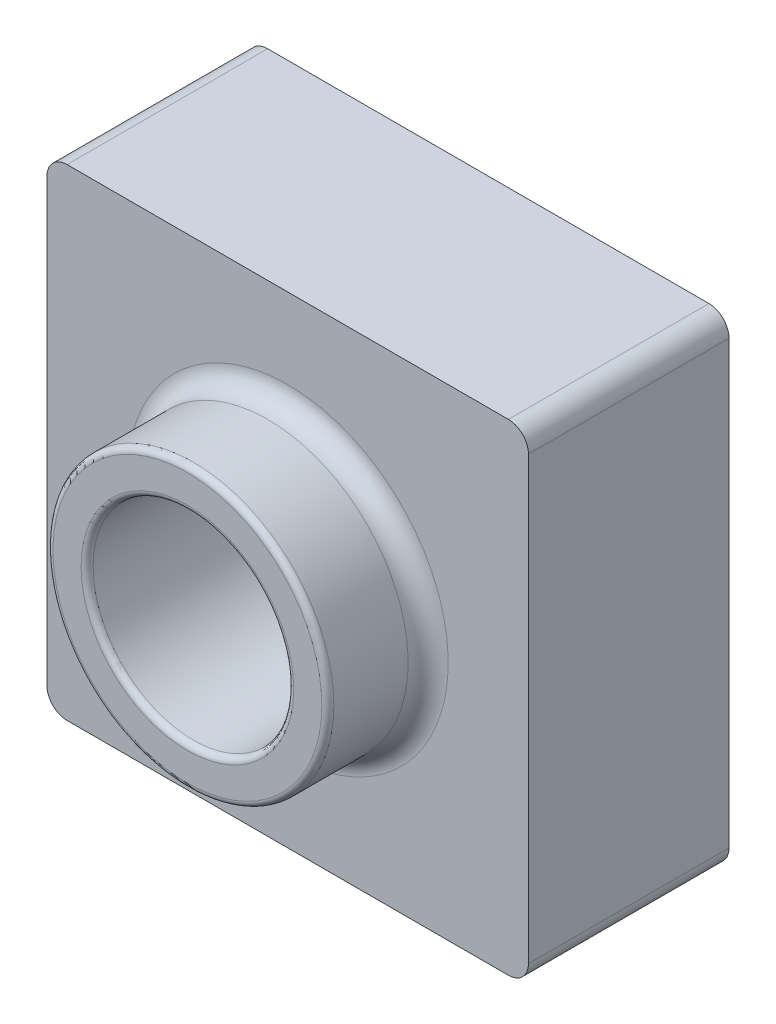
ISO-10303-21;
HEADER;
FILE_DESCRIPTION(('STEP AP214'),'2;1');
FILE_NAME('part.step','',(''),(''),'','','');
FILE_SCHEMA(('AUTOMOTIVE_DESIGN { 1 0 10303 214 1 1 1 1 }'));
ENDSEC;
DATA;
#1=APPLICATION_CONTEXT('core data for automotive mechanical design processes');
#2=APPLICATION_PROTOCOL_DEFINITION('international standard','automotive_design',2000,#1);
#3=PRODUCT_CONTEXT('',#1,'mechanical');
#4=PRODUCT('Part','Part','',(#3));
#5=PRODUCT_RELATED_PRODUCT_CATEGORY('part','',(#4));
#6=PRODUCT_DEFINITION_FORMATION('','',#4);
#7=PRODUCT_DEFINITION_CONTEXT('part definition',#1,'design');
#8=PRODUCT_DEFINITION('design','',#6,#7);
#9=PRODUCT_DEFINITION_SHAPE('','',#8);
#10=(LENGTH_UNIT() NAMED_UNIT(*) SI_UNIT(.MILLI.,.METRE.));
#11=(NAMED_UNIT(*) PLANE_ANGLE_UNIT() SI_UNIT($,.RADIAN.));
#12=(NAMED_UNIT(*) SI_UNIT($,.STERADIAN.) SOLID_ANGLE_UNIT());
#13=UNCERTAINTY_MEASURE_WITH_UNIT(LENGTH_MEASURE(1.E-05),#10,'distance_accuracy_value','');
#14=(GEOMETRIC_REPRESENTATION_CONTEXT(3) GLOBAL_UNCERTAINTY_ASSIGNED_CONTEXT((#13)) GLOBAL_UNIT_ASSIGNED_CONTEXT((#10,
#11,#12)) REPRESENTATION_CONTEXT('',''));
#15=CARTESIAN_POINT('',(0.,0.,0.));
#16=DIRECTION('',(0.,0.,1.));
#17=DIRECTION('',(1.,0.,0.));
#18=AXIS2_PLACEMENT_3D('',#15,#16,#17);
#19=CARTESIAN_POINT('',(0.,0.,-1270.));
#20=DIRECTION('',(0.,0.,-1.));
#21=DIRECTION('',(-1.,0.,0.));
#22=AXIS2_PLACEMENT_3D('',#19,#20,#21);
#23=PLANE('',#22);
#24=CARTESIAN_POINT('',(1524.,1524.,-1270.));
#25=DIRECTION('',(0.,0.,-1.));
#26=DIRECTION('',(-1.,0.,0.));
#27=AXIS2_PLACEMENT_3D('',#24,#25,#26);
#28=CIRCLE('',#27,685.8);
#29=CARTESIAN_POINT('',(838.2,1524.,-1270.));
#30=VERTEX_POINT('',#29);
#31=EDGE_CURVE('E145',#30,#30,#28,.F.);
#32=ORIENTED_EDGE('',*,*,#31,.F.);
#33=EDGE_LOOP('',(#32));
#34=FACE_BOUND('',#33,.T.);
#35=CARTESIAN_POINT('',(1524.,1524.,-1270.));
#36=DIRECTION('',(0.,0.,1.));
#37=DIRECTION('',(1.,0.,0.));
#38=AXIS2_PLACEMENT_3D('',#35,#36,#37);
#39=CIRCLE('',#38,635.);
#40=CARTESIAN_POINT('',(2159.,1524.,-1270.));
#41=VERTEX_POINT('',#40);
#42=EDGE_CURVE('E168',#41,#41,#39,.T.);
#43=ORIENTED_EDGE('',*,*,#42,.T.);
#44=EDGE_LOOP('',(#43));
#45=FACE_BOUND('',#44,.T.);
#46=ADVANCED_FACE('F33',(#34,#45),#23,.T.);
#47=CARTESIAN_POINT('',(0.,0.,-1270.));
#48=DIRECTION('',(1.,0.,0.));
#49=DIRECTION('',(0.,0.,-1.));
#50=AXIS2_PLACEMENT_3D('',#47,#48,#49);
#51=PLANE('',#50);
#52=DIRECTION('',(0.,1.,0.));
#53=VECTOR('',#52,1.);
#54=CARTESIAN_POINT('',(0.,0.,-1270.));
#55=LINE('',#54,#53);
#56=CARTESIAN_POINT('',(0.,127.,-1270.));
#57=VERTEX_POINT('',#56);
#58=CARTESIAN_POINT('',(0.,2921.,-1270.));
#59=VERTEX_POINT('',#58);
#60=EDGE_CURVE('E181',#57,#59,#55,.T.);
#61=ORIENTED_EDGE('',*,*,#60,.F.);
#62=DIRECTION('',(0.,0.,1.));
#63=VECTOR('',#62,1.);
#64=CARTESIAN_POINT('',(0.,127.,0.));
#65=LINE('',#64,#63);
#66=CARTESIAN_POINT('',(0.,127.,0.));
#67=VERTEX_POINT('',#66);
#68=EDGE_CURVE('E11',#57,#67,#65,.T.);
#69=ORIENTED_EDGE('',*,*,#68,.T.);
#70=DIRECTION('',(0.,1.,0.));
#71=VECTOR('',#70,1.);
#72=CARTESIAN_POINT('',(0.,0.,0.));
#73=LINE('',#72,#71);
#74=CARTESIAN_POINT('',(0.,2921.,0.));
#75=VERTEX_POINT('',#74);
#76=EDGE_CURVE('E180',#67,#75,#73,.T.);
#77=ORIENTED_EDGE('',*,*,#76,.T.);
#78=DIRECTION('',(0.,0.,1.));
#79=VECTOR('',#78,1.);
#80=CARTESIAN_POINT('',(0.,2921.,-1270.));
#81=LINE('',#80,#79);
#82=EDGE_CURVE('E41',#75,#59,#81,.F.);
#83=ORIENTED_EDGE('',*,*,#82,.T.);
#84=EDGE_LOOP('',(#61,#69,#77,#83));
#85=FACE_BOUND('',#84,.T.);
#86=ADVANCED_FACE('F252',(#85),#51,.F.);
#87=CARTESIAN_POINT('',(0.,3048.,-1270.));
#88=DIRECTION('',(0.,-1.,0.));
#89=DIRECTION('',(0.,0.,-1.));
#90=AXIS2_PLACEMENT_3D('',#87,#88,#89);
#91=PLANE('',#90);
#92=DIRECTION('',(1.,0.,0.));
#93=VECTOR('',#92,1.);
#94=CARTESIAN_POINT('',(0.,3048.,0.));
#95=LINE('',#94,#93);
#96=CARTESIAN_POINT('',(127.,3048.,0.));
#97=VERTEX_POINT('',#96);
#98=CARTESIAN_POINT('',(2921.,3048.,0.));
#99=VERTEX_POINT('',#98);
#100=EDGE_CURVE('E196',#97,#99,#95,.T.);
#101=ORIENTED_EDGE('',*,*,#100,.T.);
#102=DIRECTION('',(0.,0.,1.));
#103=VECTOR('',#102,1.);
#104=CARTESIAN_POINT('',(2921.,3048.,-1270.));
#105=LINE('',#104,#103);
#106=CARTESIAN_POINT('',(2921.,3048.,-1270.));
#107=VERTEX_POINT('',#106);
#108=EDGE_CURVE('E237',#99,#107,#105,.F.);
#109=ORIENTED_EDGE('',*,*,#108,.T.);
#110=DIRECTION('',(1.,0.,0.));
#111=VECTOR('',#110,1.);
#112=CARTESIAN_POINT('',(0.,3048.,-1270.));
#113=LINE('',#112,#111);
#114=CARTESIAN_POINT('',(127.,3048.,-1270.));
#115=VERTEX_POINT('',#114);
#116=EDGE_CURVE('E184',#115,#107,#113,.T.);
#117=ORIENTED_EDGE('',*,*,#116,.F.);
#118=DIRECTION('',(0.,0.,1.));
#119=VECTOR('',#118,1.);
#120=CARTESIAN_POINT('',(127.,3048.,-1270.));
#121=LINE('',#120,#119);
#122=EDGE_CURVE('E234',#115,#97,#121,.T.);
#123=ORIENTED_EDGE('',*,*,#122,.T.);
#124=EDGE_LOOP('',(#101,#109,#117,#123));
#125=FACE_BOUND('',#124,.T.);
#126=ADVANCED_FACE('F263',(#125),#91,.F.);
#127=CARTESIAN_POINT('',(3048.,0.,-1270.));
#128=DIRECTION('',(1.,0.,0.));
#129=DIRECTION('',(0.,0.,-1.));
#130=AXIS2_PLACEMENT_3D('',#127,#128,#129);
#131=PLANE('',#130);
#132=DIRECTION('',(0.,1.,0.));
#133=VECTOR('',#132,1.);
#134=CARTESIAN_POINT('',(3048.,0.,-1270.));
#135=LINE('',#134,#133);
#136=CARTESIAN_POINT('',(3048.,127.,-1270.));
#137=VERTEX_POINT('',#136);
#138=CARTESIAN_POINT('',(3048.,2921.,-1270.));
#139=VERTEX_POINT('',#138);
#140=EDGE_CURVE('E188',#137,#139,#135,.T.);
#141=ORIENTED_EDGE('',*,*,#140,.T.);
#142=DIRECTION('',(0.,0.,1.));
#143=VECTOR('',#142,1.);
#144=CARTESIAN_POINT('',(3048.,2921.,0.));
#145=LINE('',#144,#143);
#146=CARTESIAN_POINT('',(3048.,2921.,0.));
#147=VERTEX_POINT('',#146);
#148=EDGE_CURVE('E223',#139,#147,#145,.T.);
#149=ORIENTED_EDGE('',*,*,#148,.T.);
#150=DIRECTION('',(0.,1.,0.));
#151=VECTOR('',#150,1.);
#152=CARTESIAN_POINT('',(3048.,0.,0.));
#153=LINE('',#152,#151);
#154=CARTESIAN_POINT('',(3048.,127.,0.));
#155=VERTEX_POINT('',#154);
#156=EDGE_CURVE('E199',#155,#147,#153,.T.);
#157=ORIENTED_EDGE('',*,*,#156,.F.);
#158=DIRECTION('',(0.,0.,1.));
#159=VECTOR('',#158,1.);
#160=CARTESIAN_POINT('',(3048.,127.,-1270.));
#161=LINE('',#160,#159);
#162=EDGE_CURVE('E221',#155,#137,#161,.F.);
#163=ORIENTED_EDGE('',*,*,#162,.T.);
#164=EDGE_LOOP('',(#141,#149,#157,#163));
#165=FACE_BOUND('',#164,.T.);
#166=ADVANCED_FACE('F273',(#165),#131,.T.);
#167=CARTESIAN_POINT('',(0.,0.,-1270.));
#168=DIRECTION('',(0.,-1.,0.));
#169=DIRECTION('',(0.,0.,-1.));
#170=AXIS2_PLACEMENT_3D('',#167,#168,#169);
#171=PLANE('',#170);
#172=DIRECTION('',(1.,0.,0.));
#173=VECTOR('',#172,1.);
#174=CARTESIAN_POINT('',(0.,0.,-1270.));
#175=LINE('',#174,#173);
#176=CARTESIAN_POINT('',(127.,0.,-1270.));
#177=VERTEX_POINT('',#176);
#178=CARTESIAN_POINT('',(2921.,0.,-1270.));
#179=VERTEX_POINT('',#178);
#180=EDGE_CURVE('E191',#177,#179,#175,.T.);
#181=ORIENTED_EDGE('',*,*,#180,.T.);
#182=DIRECTION('',(0.,0.,1.));
#183=VECTOR('',#182,1.);
#184=CARTESIAN_POINT('',(2921.,0.,-1270.));
#185=LINE('',#184,#183);
#186=CARTESIAN_POINT('',(2921.,0.,0.));
#187=VERTEX_POINT('',#186);
#188=EDGE_CURVE('E247',#179,#187,#185,.T.);
#189=ORIENTED_EDGE('',*,*,#188,.T.);
#190=DIRECTION('',(1.,0.,0.));
#191=VECTOR('',#190,1.);
#192=CARTESIAN_POINT('',(0.,0.,0.));
#193=LINE('',#192,#191);
#194=CARTESIAN_POINT('',(127.,0.,0.));
#195=VERTEX_POINT('',#194);
#196=EDGE_CURVE('E185',#195,#187,#193,.T.);
#197=ORIENTED_EDGE('',*,*,#196,.F.);
#198=DIRECTION('',(0.,0.,1.));
#199=VECTOR('',#198,1.);
#200=CARTESIAN_POINT('',(127.,0.,-1270.));
#201=LINE('',#200,#199);
#202=EDGE_CURVE('E55',#195,#177,#201,.F.);
#203=ORIENTED_EDGE('',*,*,#202,.T.);
#204=EDGE_LOOP('',(#181,#189,#197,#203));
#205=FACE_BOUND('',#204,.T.);
#206=ADVANCED_FACE('F278',(#205),#171,.T.);
#207=DIRECTION('',(0.,1.,0.));
#208=VECTOR('',#207,1.);
#209=CARTESIAN_POINT('',(50.8,0.,-1270.));
#210=LINE('',#209,#208);
#211=CARTESIAN_POINT('',(50.8,50.8,-1270.));
#212=VERTEX_POINT('',#211);
#213=CARTESIAN_POINT('',(50.8,2997.2,-1270.));
#214=VERTEX_POINT('',#213);
#215=EDGE_CURVE('E151',#212,#214,#210,.T.);
#216=ORIENTED_EDGE('',*,*,#215,.F.);
#217=DIRECTION('',(1.,0.,0.));
#218=VECTOR('',#217,1.);
#219=CARTESIAN_POINT('',(0.,50.8,-1270.));
#220=LINE('',#219,#218);
#221=CARTESIAN_POINT('',(2997.2,50.8,-1270.));
#222=VERTEX_POINT('',#221);
#223=EDGE_CURVE('E131',#212,#222,#220,.T.);
#224=ORIENTED_EDGE('',*,*,#223,.T.);
#225=DIRECTION('',(0.,1.,0.));
#226=VECTOR('',#225,1.);
#227=CARTESIAN_POINT('',(2997.2,0.,-1270.));
#228=LINE('',#227,#226);
#229=CARTESIAN_POINT('',(2997.2,2997.2,-1270.));
#230=VERTEX_POINT('',#229);
#231=EDGE_CURVE('E172',#222,#230,#228,.T.);
#232=ORIENTED_EDGE('',*,*,#231,.T.);
#233=DIRECTION('',(1.,0.,0.));
#234=VECTOR('',#233,1.);
#235=CARTESIAN_POINT('',(0.,2997.2,-1270.));
#236=LINE('',#235,#234);
#237=EDGE_CURVE('E153',#214,#230,#236,.T.);
#238=ORIENTED_EDGE('',*,*,#237,.F.);
#239=EDGE_LOOP('',(#216,#224,#232,#238));
#240=FACE_BOUND('',#239,.T.);
#241=ORIENTED_EDGE('',*,*,#116,.T.);
#242=CARTESIAN_POINT('',(2921.,2921.,-1270.));
#243=DIRECTION('',(0.,0.,-1.));
#244=DIRECTION('',(-1.,0.,0.));
#245=AXIS2_PLACEMENT_3D('',#242,#243,#244);
#246=CIRCLE('',#245,127.);
#247=EDGE_CURVE('E244',#107,#139,#246,.T.);
#248=ORIENTED_EDGE('',*,*,#247,.T.);
#249=ORIENTED_EDGE('',*,*,#140,.F.);
#250=CARTESIAN_POINT('',(2921.,127.,-1270.));
#251=DIRECTION('',(0.,0.,-1.));
#252=DIRECTION('',(-1.,0.,0.));
#253=AXIS2_PLACEMENT_3D('',#250,#251,#252);
#254=CIRCLE('',#253,127.);
#255=EDGE_CURVE('E48',#137,#179,#254,.T.);
#256=ORIENTED_EDGE('',*,*,#255,.T.);
#257=ORIENTED_EDGE('',*,*,#180,.F.);
#258=CARTESIAN_POINT('',(127.,127.,-1270.));
#259=DIRECTION('',(0.,0.,-1.));
#260=DIRECTION('',(-1.,0.,0.));
#261=AXIS2_PLACEMENT_3D('',#258,#259,#260);
#262=CIRCLE('',#261,127.);
#263=EDGE_CURVE('E241',#177,#57,#262,.T.);
#264=ORIENTED_EDGE('',*,*,#263,.T.);
#265=ORIENTED_EDGE('',*,*,#60,.T.);
#266=CARTESIAN_POINT('',(127.,2921.,-1270.));
#267=DIRECTION('',(0.,0.,-1.));
#268=DIRECTION('',(-1.,0.,0.));
#269=AXIS2_PLACEMENT_3D('',#266,#267,#268);
#270=CIRCLE('',#269,127.);
#271=EDGE_CURVE('E239',#59,#115,#270,.T.);
#272=ORIENTED_EDGE('',*,*,#271,.T.);
#273=EDGE_LOOP('',(#241,#248,#249,#256,#257,#264,#265,#272));
#274=FACE_BOUND('',#273,.T.);
#275=ADVANCED_FACE('F257',(#240,#274),#23,.T.);
#276=CARTESIAN_POINT('',(0.,0.,0.));
#277=DIRECTION('',(0.,0.,-1.));
#278=DIRECTION('',(-1.,0.,0.));
#279=AXIS2_PLACEMENT_3D('',#276,#277,#278);
#280=PLANE('',#279);
#281=CARTESIAN_POINT('',(1524.,1524.,0.));
#282=DIRECTION('',(0.,0.,-1.));
#283=DIRECTION('',(-1.,0.,0.));
#284=AXIS2_PLACEMENT_3D('',#281,#282,#283);
#285=CIRCLE('',#284,1016.);
#286=CARTESIAN_POINT('',(508.,1524.,0.));
#287=VERTEX_POINT('',#286);
#288=EDGE_CURVE('E206',#287,#287,#285,.T.);
#289=ORIENTED_EDGE('',*,*,#288,.T.);
#290=EDGE_LOOP('',(#289));
#291=FACE_BOUND('',#290,.T.);
#292=ORIENTED_EDGE('',*,*,#156,.T.);
#293=CARTESIAN_POINT('',(2921.,2921.,0.));
#294=DIRECTION('',(0.,0.,-1.));
#295=DIRECTION('',(-1.,0.,0.));
#296=AXIS2_PLACEMENT_3D('',#293,#294,#295);
#297=CIRCLE('',#296,127.);
#298=EDGE_CURVE('E232',#147,#99,#297,.F.);
#299=ORIENTED_EDGE('',*,*,#298,.T.);
#300=ORIENTED_EDGE('',*,*,#100,.F.);
#301=CARTESIAN_POINT('',(127.,2921.,0.));
#302=DIRECTION('',(0.,0.,-1.));
#303=DIRECTION('',(-1.,0.,0.));
#304=AXIS2_PLACEMENT_3D('',#301,#302,#303);
#305=CIRCLE('',#304,127.);
#306=EDGE_CURVE('E226',#97,#75,#305,.F.);
#307=ORIENTED_EDGE('',*,*,#306,.T.);
#308=ORIENTED_EDGE('',*,*,#76,.F.);
#309=CARTESIAN_POINT('',(127.,127.,0.));
#310=DIRECTION('',(0.,0.,-1.));
#311=DIRECTION('',(-1.,0.,0.));
#312=AXIS2_PLACEMENT_3D('',#309,#310,#311);
#313=CIRCLE('',#312,127.);
#314=EDGE_CURVE('E228',#67,#195,#313,.F.);
#315=ORIENTED_EDGE('',*,*,#314,.T.);
#316=ORIENTED_EDGE('',*,*,#196,.T.);
#317=CARTESIAN_POINT('',(2921.,127.,0.));
#318=DIRECTION('',(0.,0.,-1.));
#319=DIRECTION('',(-1.,0.,0.));
#320=AXIS2_PLACEMENT_3D('',#317,#318,#319);
#321=CIRCLE('',#320,127.);
#322=EDGE_CURVE('E230',#187,#155,#321,.F.);
#323=ORIENTED_EDGE('',*,*,#322,.T.);
#324=EDGE_LOOP('',(#292,#299,#300,#307,#308,#315,#316,#323));
#325=FACE_BOUND('',#324,.T.);
#326=ADVANCED_FACE('F266',(#291,#325),#280,.F.);
#327=CARTESIAN_POINT('',(1524.,1524.,635.));
#328=DIRECTION('',(0.,0.,-1.));
#329=DIRECTION('',(-1.,0.,0.));
#330=AXIS2_PLACEMENT_3D('',#327,#328,#329);
#331=CYLINDRICAL_SURFACE('',#330,889.);
#332=CARTESIAN_POINT('',(1524.,1524.,596.9));
#333=DIRECTION('',(0.,0.,1.));
#334=DIRECTION('',(1.,0.,0.));
#335=AXIS2_PLACEMENT_3D('',#332,#333,#334);
#336=CIRCLE('',#335,889.);
#337=CARTESIAN_POINT('',(635.,1524.,596.9));
#338=VERTEX_POINT('',#337);
#339=EDGE_CURVE('E218',#338,#338,#336,.F.);
#340=CARTESIAN_POINT('',(1524.,1524.,127.));
#341=DIRECTION('',(0.,0.,-1.));
#342=DIRECTION('',(-1.,0.,0.));
#343=AXIS2_PLACEMENT_3D('',#340,#341,#342);
#344=CIRCLE('',#343,889.);
#345=CARTESIAN_POINT('',(635.,1524.,127.));
#346=VERTEX_POINT('',#345);
#347=EDGE_CURVE('E193',#346,#346,#344,.F.);
#348=CARTESIAN_POINT('',(635.,1524.,596.9));
#349=CARTESIAN_POINT('',(635.,1524.,592.005208333333));
#350=CARTESIAN_POINT('',(635.,1524.,587.110416666667));
#351=CARTESIAN_POINT('',(635.,1524.,577.320833333333));
#352=CARTESIAN_POINT('',(635.,1524.,572.426041666667));
#353=CARTESIAN_POINT('',(635.,1524.,562.636458333333));
#354=CARTESIAN_POINT('',(635.,1524.,557.741666666667));
#355=CARTESIAN_POINT('',(635.,1524.,547.952083333333));
#356=CARTESIAN_POINT('',(635.,1524.,543.057291666667));
#357=CARTESIAN_POINT('',(635.,1524.,533.267708333333));
#358=CARTESIAN_POINT('',(635.,1524.,528.372916666667));
#359=CARTESIAN_POINT('',(635.,1524.,518.583333333333));
#360=CARTESIAN_POINT('',(635.,1524.,513.688541666667));
#361=CARTESIAN_POINT('',(635.,1524.,503.898958333333));
#362=CARTESIAN_POINT('',(635.,1524.,499.004166666667));
#363=CARTESIAN_POINT('',(635.,1524.,489.214583333333));
#364=CARTESIAN_POINT('',(635.,1524.,484.319791666667));
#365=CARTESIAN_POINT('',(635.,1524.,474.530208333333));
#366=CARTESIAN_POINT('',(635.,1524.,469.635416666667));
#367=CARTESIAN_POINT('',(635.,1524.,459.845833333333));
#368=CARTESIAN_POINT('',(635.,1524.,454.951041666667));
#369=CARTESIAN_POINT('',(635.,1524.,445.161458333333));
#370=CARTESIAN_POINT('',(635.,1524.,440.266666666667));
#371=CARTESIAN_POINT('',(635.,1524.,430.477083333333));
#372=CARTESIAN_POINT('',(635.,1524.,425.582291666667));
#373=CARTESIAN_POINT('',(635.,1524.,415.792708333333));
#374=CARTESIAN_POINT('',(635.,1524.,410.897916666667));
#375=CARTESIAN_POINT('',(635.,1524.,401.108333333333));
#376=CARTESIAN_POINT('',(635.,1524.,396.213541666667));
#377=CARTESIAN_POINT('',(635.,1524.,386.423958333333));
#378=CARTESIAN_POINT('',(635.,1524.,381.529166666667));
#379=CARTESIAN_POINT('',(635.,1524.,371.739583333333));
#380=CARTESIAN_POINT('',(635.,1524.,366.844791666667));
#381=CARTESIAN_POINT('',(635.,1524.,357.055208333333));
#382=CARTESIAN_POINT('',(635.,1524.,352.160416666667));
#383=CARTESIAN_POINT('',(635.,1524.,342.370833333333));
#384=CARTESIAN_POINT('',(635.,1524.,337.476041666667));
#385=CARTESIAN_POINT('',(635.,1524.,327.686458333333));
#386=CARTESIAN_POINT('',(635.,1524.,322.791666666667));
#387=CARTESIAN_POINT('',(635.,1524.,313.002083333333));
#388=CARTESIAN_POINT('',(635.,1524.,308.107291666667));
#389=CARTESIAN_POINT('',(635.,1524.,298.317708333333));
#390=CARTESIAN_POINT('',(635.,1524.,293.422916666667));
#391=CARTESIAN_POINT('',(635.,1524.,283.633333333333));
#392=CARTESIAN_POINT('',(635.,1524.,278.738541666667));
#393=CARTESIAN_POINT('',(635.,1524.,268.948958333333));
#394=CARTESIAN_POINT('',(635.,1524.,264.054166666667));
#395=CARTESIAN_POINT('',(635.,1524.,254.264583333333));
#396=CARTESIAN_POINT('',(635.,1524.,249.369791666667));
#397=CARTESIAN_POINT('',(635.,1524.,239.580208333333));
#398=CARTESIAN_POINT('',(635.,1524.,234.685416666667));
#399=CARTESIAN_POINT('',(635.,1524.,224.895833333333));
#400=CARTESIAN_POINT('',(635.,1524.,220.001041666667));
#401=CARTESIAN_POINT('',(635.,1524.,210.211458333333));
#402=CARTESIAN_POINT('',(635.,1524.,205.316666666667));
#403=CARTESIAN_POINT('',(635.,1524.,195.527083333333));
#404=CARTESIAN_POINT('',(635.,1524.,190.632291666667));
#405=CARTESIAN_POINT('',(635.,1524.,180.842708333333));
#406=CARTESIAN_POINT('',(635.,1524.,175.947916666667));
#407=CARTESIAN_POINT('',(635.,1524.,166.158333333333));
#408=CARTESIAN_POINT('',(635.,1524.,161.263541666667));
#409=CARTESIAN_POINT('',(635.,1524.,151.473958333333));
#410=CARTESIAN_POINT('',(635.,1524.,146.579166666667));
#411=CARTESIAN_POINT('',(635.,1524.,136.789583333333));
#412=CARTESIAN_POINT('',(635.,1524.,131.894791666667));
#413=CARTESIAN_POINT('',(635.,1524.,127.));
#414=B_SPLINE_CURVE_WITH_KNOTS('',3,(#348,#349,#350,#351,#352,#353,#354,#355,#356,#357,#358,
#359,#360,#361,#362,#363,#364,#365,#366,#367,#368,#369,#370,#371,#372,#373,#374,#375,#376,#377,
#378,#379,#380,#381,#382,#383,#384,#385,#386,#387,#388,#389,#390,#391,#392,#393,#394,#395,#396,
#397,#398,#399,#400,#401,#402,#403,#404,#405,#406,#407,#408,#409,#410,#411,#412,#413),
.UNSPECIFIED.,.F.,.F.,(4,2,2,2,2,2,2,2,2,2,2,2,2,2,2,2,2,2,2,2,2,2,2,2,2,2,2,2,2,2,2,2,4),(0.,
14.684375,29.3687499999999,44.0531249999999,58.7374999999999,73.421875,88.1062499999999,
102.790625,117.475,132.159375,146.84375,161.528125,176.2125,190.896875,205.58125,220.265625,
234.95,249.634375,264.31875,279.003125,293.6875,308.371875,323.05625,337.740625,352.425,
367.109375,381.79375,396.478125,411.1625,425.846875,440.53125,455.215625,469.9),.UNSPECIFIED.);
#415=EDGE_CURVE('BSEAM304',#338,#346,#414,.T.);
#416=ORIENTED_EDGE('',*,*,#339,.T.);
#417=ORIENTED_EDGE('',*,*,#347,.T.);
#418=ORIENTED_EDGE('',*,*,#415,.T.);
#419=ORIENTED_EDGE('',*,*,#415,.F.);
#420=EDGE_LOOP('',(#416,#418,#417,#419));
#421=FACE_BOUND('',#420,.T.);
#422=ADVANCED_FACE('F304',(#421),#331,.T.);
#423=CARTESIAN_POINT('',(1524.,1524.,635.));
#424=DIRECTION('',(0.,0.,1.));
#425=DIRECTION('',(1.,0.,0.));
#426=AXIS2_PLACEMENT_3D('',#423,#424,#425);
#427=PLANE('',#426);
#428=CARTESIAN_POINT('',(1524.,1524.,635.));
#429=DIRECTION('',(0.,0.,1.));
#430=DIRECTION('',(1.,0.,0.));
#431=AXIS2_PLACEMENT_3D('',#428,#429,#430);
#432=CIRCLE('',#431,673.1);
#433=CARTESIAN_POINT('',(2197.1,1524.,635.));
#434=VERTEX_POINT('',#433);
#435=EDGE_CURVE('E215',#434,#434,#432,.F.);
#436=ORIENTED_EDGE('',*,*,#435,.T.);
#437=EDGE_LOOP('',(#436));
#438=FACE_BOUND('',#437,.T.);
#439=CARTESIAN_POINT('',(1524.,1524.,635.));
#440=DIRECTION('',(0.,0.,1.));
#441=DIRECTION('',(1.,0.,0.));
#442=AXIS2_PLACEMENT_3D('',#439,#440,#441);
#443=CIRCLE('',#442,850.9);
#444=CARTESIAN_POINT('',(2374.9,1524.,635.));
#445=VERTEX_POINT('',#444);
#446=EDGE_CURVE('E212',#445,#445,#443,.T.);
#447=ORIENTED_EDGE('',*,*,#446,.T.);
#448=EDGE_LOOP('',(#447));
#449=FACE_BOUND('',#448,.T.);
#450=ADVANCED_FACE('F350',(#438,#449),#427,.T.);
#451=CARTESIAN_POINT('',(1524.,1524.,-1270.));
#452=DIRECTION('',(0.,0.,1.));
#453=DIRECTION('',(1.,0.,0.));
#454=AXIS2_PLACEMENT_3D('',#451,#452,#453);
#455=CYLINDRICAL_SURFACE('',#454,635.);
#456=CARTESIAN_POINT('',(1524.,1524.,596.9));
#457=DIRECTION('',(0.,0.,1.));
#458=DIRECTION('',(1.,0.,0.));
#459=AXIS2_PLACEMENT_3D('',#456,#457,#458);
#460=CIRCLE('',#459,635.);
#461=CARTESIAN_POINT('',(2159.,1524.,596.9));
#462=VERTEX_POINT('',#461);
#463=EDGE_CURVE('E209',#462,#462,#460,.T.);
#464=ORIENTED_EDGE('',*,*,#463,.T.);
#465=EDGE_LOOP('',(#464));
#466=FACE_BOUND('',#465,.T.);
#467=ORIENTED_EDGE('',*,*,#42,.F.);
#468=EDGE_LOOP('',(#467));
#469=FACE_BOUND('',#468,.T.);
#470=ADVANCED_FACE('F346',(#466,#469),#455,.F.);
#471=CARTESIAN_POINT('',(1524.,1524.,127.));
#472=DIRECTION('',(0.,0.,-1.));
#473=DIRECTION('',(-1.,0.,0.));
#474=AXIS2_PLACEMENT_3D('',#471,#472,#473);
#475=TOROIDAL_SURFACE('',#474,1016.,127.);
#476=ORIENTED_EDGE('',*,*,#288,.F.);
#477=EDGE_LOOP('',(#476));
#478=FACE_BOUND('',#477,.T.);
#479=ORIENTED_EDGE('',*,*,#347,.F.);
#480=EDGE_LOOP('',(#479));
#481=FACE_BOUND('',#480,.T.);
#482=ADVANCED_FACE('F349',(#478,#481),#475,.F.);
#483=CARTESIAN_POINT('',(1524.,1524.,596.9));
#484=DIRECTION('',(0.,0.,1.));
#485=DIRECTION('',(1.,0.,0.));
#486=AXIS2_PLACEMENT_3D('',#483,#484,#485);
#487=TOROIDAL_SURFACE('',#486,673.1,38.1);
#488=ORIENTED_EDGE('',*,*,#435,.F.);
#489=EDGE_LOOP('',(#488));
#490=FACE_BOUND('',#489,.T.);
#491=ORIENTED_EDGE('',*,*,#463,.F.);
#492=EDGE_LOOP('',(#491));
#493=FACE_BOUND('',#492,.T.);
#494=ADVANCED_FACE('F363',(#490,#493),#487,.T.);
#495=CARTESIAN_POINT('',(1524.,1524.,596.9));
#496=DIRECTION('',(0.,0.,1.));
#497=DIRECTION('',(1.,0.,0.));
#498=AXIS2_PLACEMENT_3D('',#495,#496,#497);
#499=TOROIDAL_SURFACE('',#498,850.9,38.1);
#500=ORIENTED_EDGE('',*,*,#339,.F.);
#501=EDGE_LOOP('',(#500));
#502=FACE_BOUND('',#501,.T.);
#503=ORIENTED_EDGE('',*,*,#446,.F.);
#504=EDGE_LOOP('',(#503));
#505=FACE_BOUND('',#504,.T.);
#506=ADVANCED_FACE('F369',(#502,#505),#499,.T.);
#507=CARTESIAN_POINT('',(50.8,0.,-1270.));
#508=DIRECTION('',(1.,0.,0.));
#509=DIRECTION('',(0.,0.,-1.));
#510=AXIS2_PLACEMENT_3D('',#507,#508,#509);
#511=PLANE('',#510);
#512=DIRECTION('',(0.,1.,0.));
#513=VECTOR('',#512,1.);
#514=CARTESIAN_POINT('',(50.8,0.,-50.8));
#515=LINE('',#514,#513);
#516=CARTESIAN_POINT('',(50.8,50.8,-50.8));
#517=VERTEX_POINT('',#516);
#518=CARTESIAN_POINT('',(50.8,2997.2,-50.8));
#519=VERTEX_POINT('',#518);
#520=EDGE_CURVE('E138',#517,#519,#515,.T.);
#521=ORIENTED_EDGE('',*,*,#520,.F.);
#522=DIRECTION('',(0.,0.,1.));
#523=VECTOR('',#522,1.);
#524=CARTESIAN_POINT('',(50.8,50.8,-1270.));
#525=LINE('',#524,#523);
#526=EDGE_CURVE('E124',#212,#517,#525,.T.);
#527=ORIENTED_EDGE('',*,*,#526,.F.);
#528=ORIENTED_EDGE('',*,*,#215,.T.);
#529=DIRECTION('',(0.,0.,1.));
#530=VECTOR('',#529,1.);
#531=CARTESIAN_POINT('',(50.8,2997.2,-1270.));
#532=LINE('',#531,#530);
#533=EDGE_CURVE('E141',#214,#519,#532,.T.);
#534=ORIENTED_EDGE('',*,*,#533,.T.);
#535=EDGE_LOOP('',(#521,#527,#528,#534));
#536=FACE_BOUND('',#535,.T.);
#537=ADVANCED_FACE('F139',(#536),#511,.T.);
#538=CARTESIAN_POINT('',(0.,2997.2,-1270.));
#539=DIRECTION('',(0.,-1.,0.));
#540=DIRECTION('',(0.,0.,-1.));
#541=AXIS2_PLACEMENT_3D('',#538,#539,#540);
#542=PLANE('',#541);
#543=DIRECTION('',(1.,0.,0.));
#544=VECTOR('',#543,1.);
#545=CARTESIAN_POINT('',(0.,2997.2,-50.8));
#546=LINE('',#545,#544);
#547=CARTESIAN_POINT('',(2997.2,2997.2,-50.8));
#548=VERTEX_POINT('',#547);
#549=EDGE_CURVE('E144',#519,#548,#546,.T.);
#550=ORIENTED_EDGE('',*,*,#549,.F.);
#551=ORIENTED_EDGE('',*,*,#533,.F.);
#552=ORIENTED_EDGE('',*,*,#237,.T.);
#553=DIRECTION('',(0.,0.,1.));
#554=VECTOR('',#553,1.);
#555=CARTESIAN_POINT('',(2997.2,2997.2,-1270.));
#556=LINE('',#555,#554);
#557=EDGE_CURVE('E311',#230,#548,#556,.T.);
#558=ORIENTED_EDGE('',*,*,#557,.T.);
#559=EDGE_LOOP('',(#550,#551,#552,#558));
#560=FACE_BOUND('',#559,.T.);
#561=ADVANCED_FACE('F309',(#560),#542,.T.);
#562=CARTESIAN_POINT('',(2997.2,0.,-1270.));
#563=DIRECTION('',(1.,0.,0.));
#564=DIRECTION('',(0.,0.,-1.));
#565=AXIS2_PLACEMENT_3D('',#562,#563,#564);
#566=PLANE('',#565);
#567=DIRECTION('',(0.,1.,0.));
#568=VECTOR('',#567,1.);
#569=CARTESIAN_POINT('',(2997.2,0.,-50.8));
#570=LINE('',#569,#568);
#571=CARTESIAN_POINT('',(2997.2,50.8,-50.8));
#572=VERTEX_POINT('',#571);
#573=EDGE_CURVE('E150',#572,#548,#570,.T.);
#574=ORIENTED_EDGE('',*,*,#573,.T.);
#575=ORIENTED_EDGE('',*,*,#557,.F.);
#576=ORIENTED_EDGE('',*,*,#231,.F.);
#577=DIRECTION('',(0.,0.,1.));
#578=VECTOR('',#577,1.);
#579=CARTESIAN_POINT('',(2997.2,50.8,-1270.));
#580=LINE('',#579,#578);
#581=EDGE_CURVE('E134',#222,#572,#580,.T.);
#582=ORIENTED_EDGE('',*,*,#581,.T.);
#583=EDGE_LOOP('',(#574,#575,#576,#582));
#584=FACE_BOUND('',#583,.T.);
#585=ADVANCED_FACE('F316',(#584),#566,.F.);
#586=CARTESIAN_POINT('',(0.,50.8,-1270.));
#587=DIRECTION('',(0.,-1.,0.));
#588=DIRECTION('',(0.,0.,-1.));
#589=AXIS2_PLACEMENT_3D('',#586,#587,#588);
#590=PLANE('',#589);
#591=DIRECTION('',(1.,0.,0.));
#592=VECTOR('',#591,1.);
#593=CARTESIAN_POINT('',(0.,50.8,-50.8));
#594=LINE('',#593,#592);
#595=EDGE_CURVE('E129',#517,#572,#594,.T.);
#596=ORIENTED_EDGE('',*,*,#595,.T.);
#597=ORIENTED_EDGE('',*,*,#581,.F.);
#598=ORIENTED_EDGE('',*,*,#223,.F.);
#599=ORIENTED_EDGE('',*,*,#526,.T.);
#600=EDGE_LOOP('',(#596,#597,#598,#599));
#601=FACE_BOUND('',#600,.T.);
#602=ADVANCED_FACE('F126',(#601),#590,.F.);
#603=CARTESIAN_POINT('',(0.,0.,-50.8));
#604=DIRECTION('',(0.,0.,-1.));
#605=DIRECTION('',(-1.,0.,0.));
#606=AXIS2_PLACEMENT_3D('',#603,#604,#605);
#607=PLANE('',#606);
#608=CARTESIAN_POINT('',(1524.,1524.,-50.8));
#609=DIRECTION('',(0.,0.,-1.));
#610=DIRECTION('',(-1.,0.,0.));
#611=AXIS2_PLACEMENT_3D('',#608,#609,#610);
#612=CIRCLE('',#611,1016.);
#613=CARTESIAN_POINT('',(508.,1524.,-50.8));
#614=VERTEX_POINT('',#613);
#615=EDGE_CURVE('E158',#614,#614,#612,.T.);
#616=ORIENTED_EDGE('',*,*,#615,.F.);
#617=EDGE_LOOP('',(#616));
#618=FACE_BOUND('',#617,.T.);
#619=ORIENTED_EDGE('',*,*,#520,.T.);
#620=ORIENTED_EDGE('',*,*,#549,.T.);
#621=ORIENTED_EDGE('',*,*,#573,.F.);
#622=ORIENTED_EDGE('',*,*,#595,.F.);
#623=EDGE_LOOP('',(#619,#620,#621,#622));
#624=FACE_BOUND('',#623,.T.);
#625=ADVANCED_FACE('F148',(#618,#624),#607,.T.);
#626=CARTESIAN_POINT('',(1524.,1524.,635.));
#627=DIRECTION('',(0.,0.,-1.));
#628=DIRECTION('',(-1.,0.,0.));
#629=AXIS2_PLACEMENT_3D('',#626,#627,#628);
#630=CYLINDRICAL_SURFACE('',#629,838.2);
#631=CARTESIAN_POINT('',(1524.,1524.,584.2));
#632=DIRECTION('',(0.,0.,1.));
#633=DIRECTION('',(1.,0.,0.));
#634=AXIS2_PLACEMENT_3D('',#631,#632,#633);
#635=CIRCLE('',#634,838.2);
#636=CARTESIAN_POINT('',(685.8,1524.,584.2));
#637=VERTEX_POINT('',#636);
#638=EDGE_CURVE('E165',#637,#637,#635,.T.);
#639=CARTESIAN_POINT('',(1524.,1524.,127.));
#640=DIRECTION('',(0.,0.,-1.));
#641=DIRECTION('',(-1.,0.,0.));
#642=AXIS2_PLACEMENT_3D('',#639,#640,#641);
#643=CIRCLE('',#642,838.2);
#644=CARTESIAN_POINT('',(685.8,1524.,127.));
#645=VERTEX_POINT('',#644);
#646=EDGE_CURVE('E162',#645,#645,#643,.F.);
#647=CARTESIAN_POINT('',(685.8,1524.,584.2));
#648=CARTESIAN_POINT('',(685.8,1524.,579.4375));
#649=CARTESIAN_POINT('',(685.8,1524.,574.675));
#650=CARTESIAN_POINT('',(685.8,1524.,565.15));
#651=CARTESIAN_POINT('',(685.8,1524.,560.3875));
#652=CARTESIAN_POINT('',(685.8,1524.,550.8625));
#653=CARTESIAN_POINT('',(685.8,1524.,546.1));
#654=CARTESIAN_POINT('',(685.8,1524.,536.575));
#655=CARTESIAN_POINT('',(685.8,1524.,531.8125));
#656=CARTESIAN_POINT('',(685.8,1524.,522.2875));
#657=CARTESIAN_POINT('',(685.8,1524.,517.525));
#658=CARTESIAN_POINT('',(685.8,1524.,508.));
#659=CARTESIAN_POINT('',(685.8,1524.,503.2375));
#660=CARTESIAN_POINT('',(685.8,1524.,493.7125));
#661=CARTESIAN_POINT('',(685.8,1524.,488.95));
#662=CARTESIAN_POINT('',(685.8,1524.,479.425));
#663=CARTESIAN_POINT('',(685.8,1524.,474.6625));
#664=CARTESIAN_POINT('',(685.8,1524.,465.1375));
#665=CARTESIAN_POINT('',(685.8,1524.,460.375));
#666=CARTESIAN_POINT('',(685.8,1524.,450.85));
#667=CARTESIAN_POINT('',(685.8,1524.,446.0875));
#668=CARTESIAN_POINT('',(685.8,1524.,436.5625));
#669=CARTESIAN_POINT('',(685.8,1524.,431.8));
#670=CARTESIAN_POINT('',(685.8,1524.,422.275));
#671=CARTESIAN_POINT('',(685.8,1524.,417.5125));
#672=CARTESIAN_POINT('',(685.8,1524.,407.9875));
#673=CARTESIAN_POINT('',(685.8,1524.,403.225));
#674=CARTESIAN_POINT('',(685.8,1524.,393.7));
#675=CARTESIAN_POINT('',(685.8,1524.,388.9375));
#676=CARTESIAN_POINT('',(685.8,1524.,379.4125));
#677=CARTESIAN_POINT('',(685.8,1524.,374.65));
#678=CARTESIAN_POINT('',(685.8,1524.,365.125));
#679=CARTESIAN_POINT('',(685.8,1524.,360.3625));
#680=CARTESIAN_POINT('',(685.8,1524.,350.8375));
#681=CARTESIAN_POINT('',(685.8,1524.,346.075));
#682=CARTESIAN_POINT('',(685.8,1524.,336.55));
#683=CARTESIAN_POINT('',(685.8,1524.,331.7875));
#684=CARTESIAN_POINT('',(685.8,1524.,322.2625));
#685=CARTESIAN_POINT('',(685.8,1524.,317.5));
#686=CARTESIAN_POINT('',(685.8,1524.,307.975));
#687=CARTESIAN_POINT('',(685.8,1524.,303.2125));
#688=CARTESIAN_POINT('',(685.8,1524.,293.6875));
#689=CARTESIAN_POINT('',(685.8,1524.,288.925));
#690=CARTESIAN_POINT('',(685.8,1524.,279.4));
#691=CARTESIAN_POINT('',(685.8,1524.,274.6375));
#692=CARTESIAN_POINT('',(685.8,1524.,265.1125));
#693=CARTESIAN_POINT('',(685.8,1524.,260.35));
#694=CARTESIAN_POINT('',(685.8,1524.,250.825));
#695=CARTESIAN_POINT('',(685.8,1524.,246.0625));
#696=CARTESIAN_POINT('',(685.8,1524.,236.5375));
#697=CARTESIAN_POINT('',(685.8,1524.,231.775));
#698=CARTESIAN_POINT('',(685.8,1524.,222.25));
#699=CARTESIAN_POINT('',(685.8,1524.,217.4875));
#700=CARTESIAN_POINT('',(685.8,1524.,207.9625));
#701=CARTESIAN_POINT('',(685.8,1524.,203.2));
#702=CARTESIAN_POINT('',(685.8,1524.,193.675));
#703=CARTESIAN_POINT('',(685.8,1524.,188.9125));
#704=CARTESIAN_POINT('',(685.8,1524.,179.3875));
#705=CARTESIAN_POINT('',(685.8,1524.,174.625));
#706=CARTESIAN_POINT('',(685.8,1524.,165.1));
#707=CARTESIAN_POINT('',(685.8,1524.,160.3375));
#708=CARTESIAN_POINT('',(685.8,1524.,150.8125));
#709=CARTESIAN_POINT('',(685.8,1524.,146.05));
#710=CARTESIAN_POINT('',(685.8,1524.,136.525));
#711=CARTESIAN_POINT('',(685.8,1524.,131.7625));
#712=CARTESIAN_POINT('',(685.8,1524.,127.));
#713=B_SPLINE_CURVE_WITH_KNOTS('',3,(#647,#648,#649,#650,#651,#652,#653,#654,#655,#656,#657,
#658,#659,#660,#661,#662,#663,#664,#665,#666,#667,#668,#669,#670,#671,#672,#673,#674,#675,#676,
#677,#678,#679,#680,#681,#682,#683,#684,#685,#686,#687,#688,#689,#690,#691,#692,#693,#694,#695,
#696,#697,#698,#699,#700,#701,#702,#703,#704,#705,#706,#707,#708,#709,#710,#711,#712),
.UNSPECIFIED.,.F.,.F.,(4,2,2,2,2,2,2,2,2,2,2,2,2,2,2,2,2,2,2,2,2,2,2,2,2,2,2,2,2,2,2,2,4),(0.,
14.2874999999999,28.5749999999999,42.8624999999999,57.1499999999999,71.4374999999999,
85.7249999999999,100.0125,114.3,128.5875,142.875,157.1625,171.45,185.7375,200.025,214.3125,
228.6,242.8875,257.175,271.4625,285.75,300.0375,314.325,328.6125,342.9,357.1875,371.475,
385.7625,400.05,414.3375,428.625,442.9125,457.2),.UNSPECIFIED.);
#714=EDGE_CURVE('BSEAM329',#637,#645,#713,.T.);
#715=ORIENTED_EDGE('',*,*,#638,.T.);
#716=ORIENTED_EDGE('',*,*,#646,.F.);
#717=ORIENTED_EDGE('',*,*,#714,.T.);
#718=ORIENTED_EDGE('',*,*,#714,.F.);
#719=EDGE_LOOP('',(#715,#717,#716,#718));
#720=FACE_BOUND('',#719,.T.);
#721=ADVANCED_FACE('F329',(#720),#630,.F.);
#722=CARTESIAN_POINT('',(1524.,1524.,584.2));
#723=DIRECTION('',(0.,0.,1.));
#724=DIRECTION('',(1.,0.,0.));
#725=AXIS2_PLACEMENT_3D('',#722,#723,#724);
#726=PLANE('',#725);
#727=CARTESIAN_POINT('',(1524.,1524.,584.2));
#728=DIRECTION('',(0.,0.,1.));
#729=DIRECTION('',(1.,0.,0.));
#730=AXIS2_PLACEMENT_3D('',#727,#728,#729);
#731=CIRCLE('',#730,685.8);
#732=CARTESIAN_POINT('',(2209.8,1524.,584.2));
#733=VERTEX_POINT('',#732);
#734=EDGE_CURVE('E161',#733,#733,#731,.T.);
#735=ORIENTED_EDGE('',*,*,#734,.T.);
#736=EDGE_LOOP('',(#735));
#737=FACE_BOUND('',#736,.T.);
#738=ORIENTED_EDGE('',*,*,#638,.F.);
#739=EDGE_LOOP('',(#738));
#740=FACE_BOUND('',#739,.T.);
#741=ADVANCED_FACE('F333',(#737,#740),#726,.F.);
#742=CARTESIAN_POINT('',(1524.,1524.,-1270.));
#743=DIRECTION('',(0.,0.,1.));
#744=DIRECTION('',(1.,0.,0.));
#745=AXIS2_PLACEMENT_3D('',#742,#743,#744);
#746=CYLINDRICAL_SURFACE('',#745,685.8);
#747=ORIENTED_EDGE('',*,*,#734,.F.);
#748=EDGE_LOOP('',(#747));
#749=FACE_BOUND('',#748,.T.);
#750=ORIENTED_EDGE('',*,*,#31,.T.);
#751=EDGE_LOOP('',(#750));
#752=FACE_BOUND('',#751,.T.);
#753=ADVANCED_FACE('F337',(#749,#752),#746,.T.);
#754=CARTESIAN_POINT('',(1524.,1524.,127.));
#755=DIRECTION('',(0.,0.,-1.));
#756=DIRECTION('',(-1.,0.,0.));
#757=AXIS2_PLACEMENT_3D('',#754,#755,#756);
#758=TOROIDAL_SURFACE('',#757,1016.,177.8);
#759=ORIENTED_EDGE('',*,*,#615,.T.);
#760=EDGE_LOOP('',(#759));
#761=FACE_BOUND('',#760,.T.);
#762=ORIENTED_EDGE('',*,*,#646,.T.);
#763=EDGE_LOOP('',(#762));
#764=FACE_BOUND('',#763,.T.);
#765=ADVANCED_FACE('F341',(#761,#764),#758,.T.);
#766=CARTESIAN_POINT('',(2921.,2921.,-1270.));
#767=DIRECTION('',(0.,0.,-1.));
#768=DIRECTION('',(-1.,0.,0.));
#769=AXIS2_PLACEMENT_3D('',#766,#767,#768);
#770=CYLINDRICAL_SURFACE('',#769,127.);
#771=ORIENTED_EDGE('',*,*,#247,.F.);
#772=ORIENTED_EDGE('',*,*,#108,.F.);
#773=ORIENTED_EDGE('',*,*,#298,.F.);
#774=ORIENTED_EDGE('',*,*,#148,.F.);
#775=EDGE_LOOP('',(#771,#772,#773,#774));
#776=FACE_BOUND('',#775,.T.);
#777=ADVANCED_FACE('F271',(#776),#770,.T.);
#778=CARTESIAN_POINT('',(2921.,127.,-1270.));
#779=DIRECTION('',(0.,0.,1.));
#780=DIRECTION('',(1.,0.,0.));
#781=AXIS2_PLACEMENT_3D('',#778,#779,#780);
#782=CYLINDRICAL_SURFACE('',#781,127.);
#783=ORIENTED_EDGE('',*,*,#255,.F.);
#784=ORIENTED_EDGE('',*,*,#162,.F.);
#785=ORIENTED_EDGE('',*,*,#322,.F.);
#786=ORIENTED_EDGE('',*,*,#188,.F.);
#787=EDGE_LOOP('',(#783,#784,#785,#786));
#788=FACE_BOUND('',#787,.T.);
#789=ADVANCED_FACE('F277',(#788),#782,.T.);
#790=CARTESIAN_POINT('',(127.,127.,-1270.));
#791=DIRECTION('',(0.,0.,-1.));
#792=DIRECTION('',(-1.,0.,0.));
#793=AXIS2_PLACEMENT_3D('',#790,#791,#792);
#794=CYLINDRICAL_SURFACE('',#793,127.);
#795=ORIENTED_EDGE('',*,*,#263,.F.);
#796=ORIENTED_EDGE('',*,*,#202,.F.);
#797=ORIENTED_EDGE('',*,*,#314,.F.);
#798=ORIENTED_EDGE('',*,*,#68,.F.);
#799=EDGE_LOOP('',(#795,#796,#797,#798));
#800=FACE_BOUND('',#799,.T.);
#801=ADVANCED_FACE('F280',(#800),#794,.T.);
#802=CARTESIAN_POINT('',(127.,2921.,-1270.));
#803=DIRECTION('',(0.,0.,1.));
#804=DIRECTION('',(1.,0.,0.));
#805=AXIS2_PLACEMENT_3D('',#802,#803,#804);
#806=CYLINDRICAL_SURFACE('',#805,127.);
#807=ORIENTED_EDGE('',*,*,#271,.F.);
#808=ORIENTED_EDGE('',*,*,#82,.F.);
#809=ORIENTED_EDGE('',*,*,#306,.F.);
#810=ORIENTED_EDGE('',*,*,#122,.F.);
#811=EDGE_LOOP('',(#807,#808,#809,#810));
#812=FACE_BOUND('',#811,.T.);
#813=ADVANCED_FACE('F35',(#812),#806,.T.);
#814=CLOSED_SHELL('',(#46,#86,#126,#166,#206,#275,#326,#422,#450,#470,#482,#494,#506,#537,#561,
#585,#602,#625,#721,#741,#753,#765,#777,#789,#801,#813));
#815=MANIFOLD_SOLID_BREP('B2',#814);
#816=ADVANCED_BREP_SHAPE_REPRESENTATION('',(#18,#815),#14);
#817=SHAPE_DEFINITION_REPRESENTATION(#9,#816);
ENDSEC;
END-ISO-10303-21;
